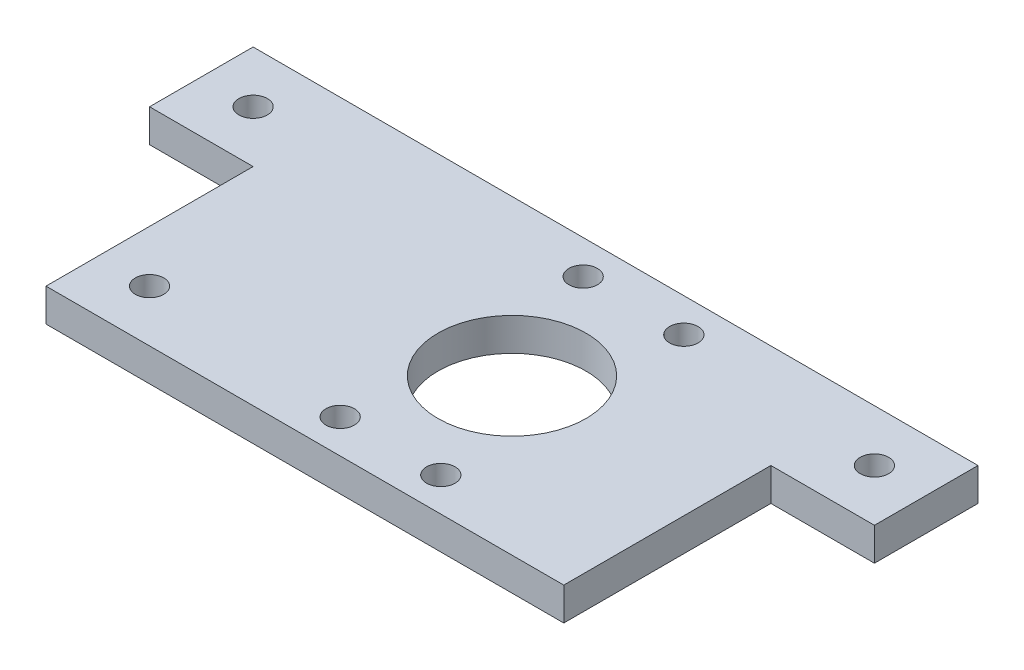
ISO-10303-21;
HEADER;
FILE_DESCRIPTION(('STEP AP214'),'2;1');
FILE_NAME('part.step','',(''),(''),'','','');
FILE_SCHEMA(('AUTOMOTIVE_DESIGN { 1 0 10303 214 1 1 1 1 }'));
ENDSEC;
DATA;
#1=APPLICATION_CONTEXT('core data for automotive mechanical design processes');
#2=APPLICATION_PROTOCOL_DEFINITION('international standard','automotive_design',2000,#1);
#3=PRODUCT_CONTEXT('',#1,'mechanical');
#4=PRODUCT('Part','Part','',(#3));
#5=PRODUCT_RELATED_PRODUCT_CATEGORY('part','',(#4));
#6=PRODUCT_DEFINITION_FORMATION('','',#4);
#7=PRODUCT_DEFINITION_CONTEXT('part definition',#1,'design');
#8=PRODUCT_DEFINITION('design','',#6,#7);
#9=PRODUCT_DEFINITION_SHAPE('','',#8);
#10=(LENGTH_UNIT() NAMED_UNIT(*) SI_UNIT(.MILLI.,.METRE.));
#11=(NAMED_UNIT(*) PLANE_ANGLE_UNIT() SI_UNIT($,.RADIAN.));
#12=(NAMED_UNIT(*) SI_UNIT($,.STERADIAN.) SOLID_ANGLE_UNIT());
#13=UNCERTAINTY_MEASURE_WITH_UNIT(LENGTH_MEASURE(1.E-05),#10,'distance_accuracy_value','');
#14=(GEOMETRIC_REPRESENTATION_CONTEXT(3) GLOBAL_UNCERTAINTY_ASSIGNED_CONTEXT((#13)) GLOBAL_UNIT_ASSIGNED_CONTEXT((#10,
#11,#12)) REPRESENTATION_CONTEXT('',''));
#15=CARTESIAN_POINT('',(0.,0.,0.));
#16=DIRECTION('',(0.,0.,1.));
#17=DIRECTION('',(1.,0.,0.));
#18=AXIS2_PLACEMENT_3D('',#15,#16,#17);
#19=CARTESIAN_POINT('',(-58.7953991363547,6.35,-3.76310779408653));
#20=DIRECTION('',(1.,0.,0.));
#21=DIRECTION('',(0.,0.,-1.));
#22=AXIS2_PLACEMENT_3D('',#19,#20,#21);
#23=PLANE('',#22);
#24=DIRECTION('',(0.,0.,1.));
#25=VECTOR('',#24,1.);
#26=CARTESIAN_POINT('',(-58.7953991363547,0.,-3.76310779408653));
#27=LINE('',#26,#25);
#28=CARTESIAN_POINT('',(-58.7953991363547,0.,-63.7631077940865));
#29=VERTEX_POINT('',#28);
#30=CARTESIAN_POINT('',(-58.7953991363547,0.,-43.7631077940865));
#31=VERTEX_POINT('',#30);
#32=EDGE_CURVE('E127',#29,#31,#27,.T.);
#33=ORIENTED_EDGE('',*,*,#32,.T.);
#34=DIRECTION('',(0.,1.,0.));
#35=VECTOR('',#34,1.);
#36=CARTESIAN_POINT('',(-58.7953991363547,-0.00100000000000013,-43.7631077940865));
#37=LINE('',#36,#35);
#38=CARTESIAN_POINT('',(-58.7953991363547,6.35,-43.7631077940865));
#39=VERTEX_POINT('',#38);
#40=EDGE_CURVE('E198',#31,#39,#37,.T.);
#41=ORIENTED_EDGE('',*,*,#40,.T.);
#42=DIRECTION('',(0.,0.,1.));
#43=VECTOR('',#42,1.);
#44=CARTESIAN_POINT('',(-58.7953991363547,6.35,-3.76310779408653));
#45=LINE('',#44,#43);
#46=CARTESIAN_POINT('',(-58.7953991363547,6.35,-63.7631077940865));
#47=VERTEX_POINT('',#46);
#48=EDGE_CURVE('E136',#47,#39,#45,.T.);
#49=ORIENTED_EDGE('',*,*,#48,.F.);
#50=DIRECTION('',(0.,-1.,0.));
#51=VECTOR('',#50,1.);
#52=CARTESIAN_POINT('',(-58.7953991363547,6.35,-63.7631077940865));
#53=LINE('',#52,#51);
#54=EDGE_CURVE('E46',#47,#29,#53,.T.);
#55=ORIENTED_EDGE('',*,*,#54,.T.);
#56=EDGE_LOOP('',(#33,#41,#49,#55));
#57=FACE_BOUND('',#56,.T.);
#58=ADVANCED_FACE('F39',(#57),#23,.F.);
#59=CARTESIAN_POINT('',(-58.7953991363547,6.35,-3.76310779408653));
#60=DIRECTION('',(0.,0.,-1.));
#61=DIRECTION('',(-1.,0.,0.));
#62=AXIS2_PLACEMENT_3D('',#59,#60,#61);
#63=PLANE('',#62);
#64=DIRECTION('',(1.,0.,0.));
#65=VECTOR('',#64,1.);
#66=CARTESIAN_POINT('',(-58.7953991363547,6.35,-3.76310779408653));
#67=LINE('',#66,#65);
#68=CARTESIAN_POINT('',(-38.7953991363547,6.35,-3.76310779408653));
#69=VERTEX_POINT('',#68);
#70=CARTESIAN_POINT('',(61.2046008636453,6.35,-3.76310779408653));
#71=VERTEX_POINT('',#70);
#72=EDGE_CURVE('E119',#69,#71,#67,.T.);
#73=ORIENTED_EDGE('',*,*,#72,.F.);
#74=DIRECTION('',(0.,1.,0.));
#75=VECTOR('',#74,1.);
#76=CARTESIAN_POINT('',(-38.7953991363547,-0.00100000000000013,-3.76310779408653));
#77=LINE('',#76,#75);
#78=CARTESIAN_POINT('',(-38.7953991363547,0.,-3.76310779408653));
#79=VERTEX_POINT('',#78);
#80=EDGE_CURVE('E104',#79,#69,#77,.T.);
#81=ORIENTED_EDGE('',*,*,#80,.F.);
#82=DIRECTION('',(1.,0.,0.));
#83=VECTOR('',#82,1.);
#84=CARTESIAN_POINT('',(-58.7953991363547,0.,-3.76310779408653));
#85=LINE('',#84,#83);
#86=CARTESIAN_POINT('',(61.2046008636453,0.,-3.76310779408653));
#87=VERTEX_POINT('',#86);
#88=EDGE_CURVE('E117',#79,#87,#85,.T.);
#89=ORIENTED_EDGE('',*,*,#88,.T.);
#90=DIRECTION('',(0.,1.,0.));
#91=VECTOR('',#90,1.);
#92=CARTESIAN_POINT('',(61.2046008636453,-0.00100000000000013,-3.76310779408653));
#93=LINE('',#92,#91);
#94=EDGE_CURVE('E182',#87,#71,#93,.T.);
#95=ORIENTED_EDGE('',*,*,#94,.T.);
#96=EDGE_LOOP('',(#73,#81,#89,#95));
#97=FACE_BOUND('',#96,.T.);
#98=ADVANCED_FACE('F115',(#97),#63,.F.);
#99=CARTESIAN_POINT('',(81.2046008636453,6.35,-3.76310779408653));
#100=DIRECTION('',(-1.,0.,0.));
#101=DIRECTION('',(0.,0.,1.));
#102=AXIS2_PLACEMENT_3D('',#99,#100,#101);
#103=PLANE('',#102);
#104=DIRECTION('',(0.,0.,-1.));
#105=VECTOR('',#104,1.);
#106=CARTESIAN_POINT('',(81.2046008636453,6.35,-3.76310779408653));
#107=LINE('',#106,#105);
#108=CARTESIAN_POINT('',(81.2046008636453,6.35,-43.7631077940865));
#109=VERTEX_POINT('',#108);
#110=CARTESIAN_POINT('',(81.2046008636453,6.35,-63.7631077940865));
#111=VERTEX_POINT('',#110);
#112=EDGE_CURVE('E143',#109,#111,#107,.T.);
#113=ORIENTED_EDGE('',*,*,#112,.F.);
#114=DIRECTION('',(0.,1.,0.));
#115=VECTOR('',#114,1.);
#116=CARTESIAN_POINT('',(81.2046008636453,-0.00100000000000013,-43.7631077940865));
#117=LINE('',#116,#115);
#118=CARTESIAN_POINT('',(81.2046008636453,0.,-43.7631077940865));
#119=VERTEX_POINT('',#118);
#120=EDGE_CURVE('E183',#119,#109,#117,.T.);
#121=ORIENTED_EDGE('',*,*,#120,.F.);
#122=DIRECTION('',(0.,0.,-1.));
#123=VECTOR('',#122,1.);
#124=CARTESIAN_POINT('',(81.2046008636453,0.,-3.76310779408653));
#125=LINE('',#124,#123);
#126=CARTESIAN_POINT('',(81.2046008636453,0.,-63.7631077940865));
#127=VERTEX_POINT('',#126);
#128=EDGE_CURVE('E126',#119,#127,#125,.T.);
#129=ORIENTED_EDGE('',*,*,#128,.T.);
#130=DIRECTION('',(0.,-1.,0.));
#131=VECTOR('',#130,1.);
#132=CARTESIAN_POINT('',(81.2046008636453,6.35,-63.7631077940865));
#133=LINE('',#132,#131);
#134=EDGE_CURVE('E11',#111,#127,#133,.T.);
#135=ORIENTED_EDGE('',*,*,#134,.F.);
#136=EDGE_LOOP('',(#113,#121,#129,#135));
#137=FACE_BOUND('',#136,.T.);
#138=ADVANCED_FACE('F255',(#137),#103,.F.);
#139=CARTESIAN_POINT('',(-58.7953991363547,6.35,-63.7631077940865));
#140=DIRECTION('',(0.,0.,1.));
#141=DIRECTION('',(1.,0.,0.));
#142=AXIS2_PLACEMENT_3D('',#139,#140,#141);
#143=PLANE('',#142);
#144=DIRECTION('',(-1.,0.,0.));
#145=VECTOR('',#144,1.);
#146=CARTESIAN_POINT('',(-58.7953991363547,0.,-63.7631077940865));
#147=LINE('',#146,#145);
#148=EDGE_CURVE('E129',#127,#29,#147,.T.);
#149=ORIENTED_EDGE('',*,*,#148,.T.);
#150=ORIENTED_EDGE('',*,*,#54,.F.);
#151=DIRECTION('',(-1.,0.,0.));
#152=VECTOR('',#151,1.);
#153=CARTESIAN_POINT('',(-58.7953991363547,6.35,-63.7631077940865));
#154=LINE('',#153,#152);
#155=EDGE_CURVE('E138',#111,#47,#154,.T.);
#156=ORIENTED_EDGE('',*,*,#155,.F.);
#157=ORIENTED_EDGE('',*,*,#134,.T.);
#158=EDGE_LOOP('',(#149,#150,#156,#157));
#159=FACE_BOUND('',#158,.T.);
#160=ADVANCED_FACE('F232',(#159),#143,.F.);
#161=CARTESIAN_POINT('',(0.,6.35,0.));
#162=DIRECTION('',(0.,-1.,0.));
#163=DIRECTION('',(0.,0.,-1.));
#164=AXIS2_PLACEMENT_3D('',#161,#162,#163);
#165=PLANE('',#164);
#166=CARTESIAN_POINT('',(71.2046008636453,6.35,-53.7631077940865));
#167=DIRECTION('',(0.,1.,0.));
#168=DIRECTION('',(0.,0.,1.));
#169=AXIS2_PLACEMENT_3D('',#166,#167,#168);
#170=CIRCLE('',#169,2.75000000000001);
#171=CARTESIAN_POINT('',(71.2046008636453,6.35,-51.0131077940865));
#172=VERTEX_POINT('',#171);
#173=EDGE_CURVE('E192',#172,#172,#170,.T.);
#174=ORIENTED_EDGE('',*,*,#173,.F.);
#175=EDGE_LOOP('',(#174));
#176=FACE_BOUND('',#175,.T.);
#177=CARTESIAN_POINT('',(-48.7953991363547,6.35,-53.7631077940865));
#178=DIRECTION('',(0.,1.,0.));
#179=DIRECTION('',(0.,0.,1.));
#180=AXIS2_PLACEMENT_3D('',#177,#178,#179);
#181=CIRCLE('',#180,2.75);
#182=CARTESIAN_POINT('',(-48.7953991363547,6.35,-51.0131077940865));
#183=VERTEX_POINT('',#182);
#184=EDGE_CURVE('E213',#183,#183,#181,.T.);
#185=ORIENTED_EDGE('',*,*,#184,.F.);
#186=EDGE_LOOP('',(#185));
#187=FACE_BOUND('',#186,.T.);
#188=CARTESIAN_POINT('',(-28.7953991363547,6.35,-13.7631077940865));
#189=DIRECTION('',(0.,1.,0.));
#190=DIRECTION('',(0.,0.,1.));
#191=AXIS2_PLACEMENT_3D('',#188,#189,#190);
#192=CIRCLE('',#191,2.75);
#193=CARTESIAN_POINT('',(-28.7953991363547,6.35,-11.0131077940865));
#194=VERTEX_POINT('',#193);
#195=EDGE_CURVE('E207',#194,#194,#192,.T.);
#196=ORIENTED_EDGE('',*,*,#195,.F.);
#197=EDGE_LOOP('',(#196));
#198=FACE_BOUND('',#197,.T.);
#199=CARTESIAN_POINT('',(30.9246008636453,6.35,-57.2297138546143));
#200=DIRECTION('',(0.,1.,0.));
#201=DIRECTION('',(0.,0.,1.));
#202=AXIS2_PLACEMENT_3D('',#199,#200,#201);
#203=CIRCLE('',#202,2.75);
#204=CARTESIAN_POINT('',(30.9246008636453,6.35,-54.4797138546143));
#205=VERTEX_POINT('',#204);
#206=EDGE_CURVE('E160',#205,#205,#203,.T.);
#207=ORIENTED_EDGE('',*,*,#206,.F.);
#208=EDGE_LOOP('',(#207));
#209=FACE_BOUND('',#208,.T.);
#210=CARTESIAN_POINT('',(11.4846008636453,6.35,-57.2297138546143));
#211=DIRECTION('',(0.,1.,0.));
#212=DIRECTION('',(0.,0.,1.));
#213=AXIS2_PLACEMENT_3D('',#210,#211,#212);
#214=CIRCLE('',#213,2.74999999999998);
#215=CARTESIAN_POINT('',(11.4846008636453,6.35,-54.4797138546143));
#216=VERTEX_POINT('',#215);
#217=EDGE_CURVE('E167',#216,#216,#214,.T.);
#218=ORIENTED_EDGE('',*,*,#217,.F.);
#219=EDGE_LOOP('',(#218));
#220=FACE_BOUND('',#219,.T.);
#221=CARTESIAN_POINT('',(11.4846008636453,6.35,-10.2965017335587));
#222=DIRECTION('',(0.,1.,0.));
#223=DIRECTION('',(0.,0.,1.));
#224=AXIS2_PLACEMENT_3D('',#221,#222,#223);
#225=CIRCLE('',#224,2.74999999999999);
#226=CARTESIAN_POINT('',(11.4846008636453,6.35,-7.54650173355873));
#227=VERTEX_POINT('',#226);
#228=EDGE_CURVE('E173',#227,#227,#225,.T.);
#229=ORIENTED_EDGE('',*,*,#228,.F.);
#230=EDGE_LOOP('',(#229));
#231=FACE_BOUND('',#230,.T.);
#232=CARTESIAN_POINT('',(30.9246008636453,6.35,-10.2965017335587));
#233=DIRECTION('',(0.,1.,0.));
#234=DIRECTION('',(0.,0.,1.));
#235=AXIS2_PLACEMENT_3D('',#232,#233,#234);
#236=CIRCLE('',#235,2.75);
#237=CARTESIAN_POINT('',(30.9246008636453,6.35,-7.54650173355872));
#238=VERTEX_POINT('',#237);
#239=EDGE_CURVE('E154',#238,#238,#236,.T.);
#240=ORIENTED_EDGE('',*,*,#239,.F.);
#241=EDGE_LOOP('',(#240));
#242=FACE_BOUND('',#241,.T.);
#243=CARTESIAN_POINT('',(21.2046008636453,6.35,-33.7631077940865));
#244=DIRECTION('',(0.,1.,0.));
#245=DIRECTION('',(0.,0.,1.));
#246=AXIS2_PLACEMENT_3D('',#243,#244,#245);
#247=CIRCLE('',#246,14.295);
#248=CARTESIAN_POINT('',(21.2046008636453,6.35,-19.4681077940865));
#249=VERTEX_POINT('',#248);
#250=EDGE_CURVE('E151',#249,#249,#247,.T.);
#251=ORIENTED_EDGE('',*,*,#250,.F.);
#252=EDGE_LOOP('',(#251));
#253=FACE_BOUND('',#252,.T.);
#254=ORIENTED_EDGE('',*,*,#48,.T.);
#255=DIRECTION('',(-1.,0.,0.));
#256=VECTOR('',#255,1.);
#257=CARTESIAN_POINT('',(-58.7953991363547,6.35,-43.7631077940865));
#258=LINE('',#257,#256);
#259=CARTESIAN_POINT('',(-38.7953991363547,6.35,-43.7631077940865));
#260=VERTEX_POINT('',#259);
#261=EDGE_CURVE('E120',#260,#39,#258,.T.);
#262=ORIENTED_EDGE('',*,*,#261,.F.);
#263=DIRECTION('',(0.,0.,-1.));
#264=VECTOR('',#263,1.);
#265=CARTESIAN_POINT('',(-38.7953991363547,6.35,-3.76310779408653));
#266=LINE('',#265,#264);
#267=EDGE_CURVE('E201',#69,#260,#266,.T.);
#268=ORIENTED_EDGE('',*,*,#267,.F.);
#269=ORIENTED_EDGE('',*,*,#72,.T.);
#270=DIRECTION('',(0.,0.,1.));
#271=VECTOR('',#270,1.);
#272=CARTESIAN_POINT('',(61.2046008636453,6.35,-3.76310779408653));
#273=LINE('',#272,#271);
#274=CARTESIAN_POINT('',(61.2046008636453,6.35,-43.7631077940865));
#275=VERTEX_POINT('',#274);
#276=EDGE_CURVE('E185',#275,#71,#273,.T.);
#277=ORIENTED_EDGE('',*,*,#276,.F.);
#278=DIRECTION('',(-1.,0.,0.));
#279=VECTOR('',#278,1.);
#280=CARTESIAN_POINT('',(81.2046008636453,6.35,-43.7631077940865));
#281=LINE('',#280,#279);
#282=EDGE_CURVE('E189',#109,#275,#281,.T.);
#283=ORIENTED_EDGE('',*,*,#282,.F.);
#284=ORIENTED_EDGE('',*,*,#112,.T.);
#285=ORIENTED_EDGE('',*,*,#155,.T.);
#286=EDGE_LOOP('',(#254,#262,#268,#269,#277,#283,#284,#285));
#287=FACE_BOUND('',#286,.T.);
#288=ADVANCED_FACE('F229',(#176,#187,#198,#209,#220,#231,#242,#253,#287),#165,.F.);
#289=CARTESIAN_POINT('',(0.,0.,0.));
#290=DIRECTION('',(0.,-1.,0.));
#291=DIRECTION('',(0.,0.,-1.));
#292=AXIS2_PLACEMENT_3D('',#289,#290,#291);
#293=PLANE('',#292);
#294=DIRECTION('',(-1.,0.,0.));
#295=VECTOR('',#294,1.);
#296=CARTESIAN_POINT('',(-58.7953991363547,0.,-43.7631077940865));
#297=LINE('',#296,#295);
#298=CARTESIAN_POINT('',(-38.7953991363547,0.,-43.7631077940865));
#299=VERTEX_POINT('',#298);
#300=EDGE_CURVE('E110',#299,#31,#297,.T.);
#301=ORIENTED_EDGE('',*,*,#300,.T.);
#302=ORIENTED_EDGE('',*,*,#32,.F.);
#303=ORIENTED_EDGE('',*,*,#148,.F.);
#304=ORIENTED_EDGE('',*,*,#128,.F.);
#305=DIRECTION('',(-1.,0.,0.));
#306=VECTOR('',#305,1.);
#307=CARTESIAN_POINT('',(81.2046008636453,0.,-43.7631077940865));
#308=LINE('',#307,#306);
#309=CARTESIAN_POINT('',(61.2046008636453,0.,-43.7631077940865));
#310=VERTEX_POINT('',#309);
#311=EDGE_CURVE('E161',#119,#310,#308,.T.);
#312=ORIENTED_EDGE('',*,*,#311,.T.);
#313=DIRECTION('',(0.,0.,1.));
#314=VECTOR('',#313,1.);
#315=CARTESIAN_POINT('',(61.2046008636453,0.,-3.76310779408653));
#316=LINE('',#315,#314);
#317=EDGE_CURVE('E109',#310,#87,#316,.T.);
#318=ORIENTED_EDGE('',*,*,#317,.T.);
#319=ORIENTED_EDGE('',*,*,#88,.F.);
#320=DIRECTION('',(0.,0.,-1.));
#321=VECTOR('',#320,1.);
#322=CARTESIAN_POINT('',(-38.7953991363547,0.,-3.76310779408653));
#323=LINE('',#322,#321);
#324=EDGE_CURVE('E101',#79,#299,#323,.T.);
#325=ORIENTED_EDGE('',*,*,#324,.T.);
#326=EDGE_LOOP('',(#301,#302,#303,#304,#312,#318,#319,#325));
#327=FACE_BOUND('',#326,.T.);
#328=CARTESIAN_POINT('',(71.2046008636453,0.,-53.7631077940865));
#329=DIRECTION('',(0.,-1.,0.));
#330=DIRECTION('',(0.,0.,-1.));
#331=AXIS2_PLACEMENT_3D('',#328,#329,#330);
#332=CIRCLE('',#331,2.75000000000001);
#333=CARTESIAN_POINT('',(71.2046008636453,0.,-56.5131077940865));
#334=VERTEX_POINT('',#333);
#335=EDGE_CURVE('E195',#334,#334,#332,.F.);
#336=ORIENTED_EDGE('',*,*,#335,.T.);
#337=EDGE_LOOP('',(#336));
#338=FACE_BOUND('',#337,.T.);
#339=CARTESIAN_POINT('',(-48.7953991363547,0.,-53.7631077940865));
#340=DIRECTION('',(0.,-1.,0.));
#341=DIRECTION('',(0.,0.,-1.));
#342=AXIS2_PLACEMENT_3D('',#339,#340,#341);
#343=CIRCLE('',#342,2.75);
#344=CARTESIAN_POINT('',(-48.7953991363547,0.,-56.5131077940865));
#345=VERTEX_POINT('',#344);
#346=EDGE_CURVE('E196',#345,#345,#343,.F.);
#347=ORIENTED_EDGE('',*,*,#346,.T.);
#348=EDGE_LOOP('',(#347));
#349=FACE_BOUND('',#348,.T.);
#350=CARTESIAN_POINT('',(-28.7953991363547,0.,-13.7631077940865));
#351=DIRECTION('',(0.,-1.,0.));
#352=DIRECTION('',(0.,0.,-1.));
#353=AXIS2_PLACEMENT_3D('',#350,#351,#352);
#354=CIRCLE('',#353,2.75);
#355=CARTESIAN_POINT('',(-28.7953991363547,0.,-16.5131077940865));
#356=VERTEX_POINT('',#355);
#357=EDGE_CURVE('E210',#356,#356,#354,.F.);
#358=ORIENTED_EDGE('',*,*,#357,.T.);
#359=EDGE_LOOP('',(#358));
#360=FACE_BOUND('',#359,.T.);
#361=CARTESIAN_POINT('',(30.9246008636453,0.,-57.2297138546143));
#362=DIRECTION('',(0.,1.,0.));
#363=DIRECTION('',(0.,0.,1.));
#364=AXIS2_PLACEMENT_3D('',#361,#362,#363);
#365=CIRCLE('',#364,2.75);
#366=CARTESIAN_POINT('',(30.9246008636453,0.,-54.4797138546143));
#367=VERTEX_POINT('',#366);
#368=EDGE_CURVE('E157',#367,#367,#365,.T.);
#369=ORIENTED_EDGE('',*,*,#368,.T.);
#370=EDGE_LOOP('',(#369));
#371=FACE_BOUND('',#370,.T.);
#372=CARTESIAN_POINT('',(11.4846008636453,0.,-57.2297138546143));
#373=DIRECTION('',(0.,1.,0.));
#374=DIRECTION('',(0.,0.,1.));
#375=AXIS2_PLACEMENT_3D('',#372,#373,#374);
#376=CIRCLE('',#375,2.74999999999998);
#377=CARTESIAN_POINT('',(11.4846008636453,0.,-54.4797138546143));
#378=VERTEX_POINT('',#377);
#379=EDGE_CURVE('E164',#378,#378,#376,.T.);
#380=ORIENTED_EDGE('',*,*,#379,.T.);
#381=EDGE_LOOP('',(#380));
#382=FACE_BOUND('',#381,.T.);
#383=CARTESIAN_POINT('',(11.4846008636453,0.,-10.2965017335587));
#384=DIRECTION('',(0.,1.,0.));
#385=DIRECTION('',(0.,0.,1.));
#386=AXIS2_PLACEMENT_3D('',#383,#384,#385);
#387=CIRCLE('',#386,2.74999999999999);
#388=CARTESIAN_POINT('',(11.4846008636453,0.,-7.54650173355873));
#389=VERTEX_POINT('',#388);
#390=EDGE_CURVE('E170',#389,#389,#387,.T.);
#391=ORIENTED_EDGE('',*,*,#390,.T.);
#392=EDGE_LOOP('',(#391));
#393=FACE_BOUND('',#392,.T.);
#394=CARTESIAN_POINT('',(30.9246008636453,0.,-10.2965017335587));
#395=DIRECTION('',(0.,1.,0.));
#396=DIRECTION('',(0.,0.,1.));
#397=AXIS2_PLACEMENT_3D('',#394,#395,#396);
#398=CIRCLE('',#397,2.75);
#399=CARTESIAN_POINT('',(30.9246008636453,0.,-7.54650173355872));
#400=VERTEX_POINT('',#399);
#401=EDGE_CURVE('E176',#400,#400,#398,.T.);
#402=ORIENTED_EDGE('',*,*,#401,.T.);
#403=EDGE_LOOP('',(#402));
#404=FACE_BOUND('',#403,.T.);
#405=CARTESIAN_POINT('',(21.2046008636453,0.,-33.7631077940865));
#406=DIRECTION('',(0.,1.,0.));
#407=DIRECTION('',(0.,0.,1.));
#408=AXIS2_PLACEMENT_3D('',#405,#406,#407);
#409=CIRCLE('',#408,14.295);
#410=CARTESIAN_POINT('',(21.2046008636453,0.,-19.4681077940865));
#411=VERTEX_POINT('',#410);
#412=EDGE_CURVE('E132',#411,#411,#409,.T.);
#413=ORIENTED_EDGE('',*,*,#412,.T.);
#414=EDGE_LOOP('',(#413));
#415=FACE_BOUND('',#414,.T.);
#416=ADVANCED_FACE('F123',(#327,#338,#349,#360,#371,#382,#393,#404,#415),#293,.T.);
#417=CARTESIAN_POINT('',(21.2046008636453,0.,-33.7631077940865));
#418=DIRECTION('',(0.,1.,0.));
#419=DIRECTION('',(0.,0.,1.));
#420=AXIS2_PLACEMENT_3D('',#417,#418,#419);
#421=CYLINDRICAL_SURFACE('',#420,14.295);
#422=ORIENTED_EDGE('',*,*,#412,.F.);
#423=EDGE_LOOP('',(#422));
#424=FACE_BOUND('',#423,.T.);
#425=ORIENTED_EDGE('',*,*,#250,.T.);
#426=EDGE_LOOP('',(#425));
#427=FACE_BOUND('',#426,.T.);
#428=ADVANCED_FACE('F286',(#424,#427),#421,.F.);
#429=CARTESIAN_POINT('',(30.9246008636453,0.,-10.2965017335587));
#430=DIRECTION('',(0.,1.,0.));
#431=DIRECTION('',(0.,0.,1.));
#432=AXIS2_PLACEMENT_3D('',#429,#430,#431);
#433=CYLINDRICAL_SURFACE('',#432,2.75);
#434=ORIENTED_EDGE('',*,*,#401,.F.);
#435=EDGE_LOOP('',(#434));
#436=FACE_BOUND('',#435,.T.);
#437=ORIENTED_EDGE('',*,*,#239,.T.);
#438=EDGE_LOOP('',(#437));
#439=FACE_BOUND('',#438,.T.);
#440=ADVANCED_FACE('F289',(#436,#439),#433,.F.);
#441=CARTESIAN_POINT('',(11.4846008636453,0.,-10.2965017335587));
#442=DIRECTION('',(0.,1.,0.));
#443=DIRECTION('',(0.,0.,1.));
#444=AXIS2_PLACEMENT_3D('',#441,#442,#443);
#445=CYLINDRICAL_SURFACE('',#444,2.74999999999999);
#446=ORIENTED_EDGE('',*,*,#390,.F.);
#447=EDGE_LOOP('',(#446));
#448=FACE_BOUND('',#447,.T.);
#449=ORIENTED_EDGE('',*,*,#228,.T.);
#450=EDGE_LOOP('',(#449));
#451=FACE_BOUND('',#450,.T.);
#452=ADVANCED_FACE('F294',(#448,#451),#445,.F.);
#453=CARTESIAN_POINT('',(11.4846008636453,0.,-57.2297138546143));
#454=DIRECTION('',(0.,1.,0.));
#455=DIRECTION('',(0.,0.,1.));
#456=AXIS2_PLACEMENT_3D('',#453,#454,#455);
#457=CYLINDRICAL_SURFACE('',#456,2.74999999999998);
#458=ORIENTED_EDGE('',*,*,#379,.F.);
#459=EDGE_LOOP('',(#458));
#460=FACE_BOUND('',#459,.T.);
#461=ORIENTED_EDGE('',*,*,#217,.T.);
#462=EDGE_LOOP('',(#461));
#463=FACE_BOUND('',#462,.T.);
#464=ADVANCED_FACE('F271',(#460,#463),#457,.F.);
#465=CARTESIAN_POINT('',(30.9246008636453,0.,-57.2297138546143));
#466=DIRECTION('',(0.,1.,0.));
#467=DIRECTION('',(0.,0.,1.));
#468=AXIS2_PLACEMENT_3D('',#465,#466,#467);
#469=CYLINDRICAL_SURFACE('',#468,2.75);
#470=ORIENTED_EDGE('',*,*,#368,.F.);
#471=EDGE_LOOP('',(#470));
#472=FACE_BOUND('',#471,.T.);
#473=ORIENTED_EDGE('',*,*,#206,.T.);
#474=EDGE_LOOP('',(#473));
#475=FACE_BOUND('',#474,.T.);
#476=ADVANCED_FACE('F263',(#472,#475),#469,.F.);
#477=CARTESIAN_POINT('',(61.2046008636453,-0.00100000000000013,-3.76310779408653));
#478=DIRECTION('',(-1.,0.,0.));
#479=DIRECTION('',(0.,0.,1.));
#480=AXIS2_PLACEMENT_3D('',#477,#478,#479);
#481=PLANE('',#480);
#482=DIRECTION('',(0.,1.,0.));
#483=VECTOR('',#482,1.);
#484=CARTESIAN_POINT('',(61.2046008636453,-0.00100000000000013,-43.7631077940865));
#485=LINE('',#484,#483);
#486=EDGE_CURVE('E61',#310,#275,#485,.T.);
#487=ORIENTED_EDGE('',*,*,#486,.T.);
#488=ORIENTED_EDGE('',*,*,#276,.T.);
#489=ORIENTED_EDGE('',*,*,#94,.F.);
#490=ORIENTED_EDGE('',*,*,#317,.F.);
#491=EDGE_LOOP('',(#487,#488,#489,#490));
#492=FACE_BOUND('',#491,.T.);
#493=ADVANCED_FACE('F261',(#492),#481,.F.);
#494=CARTESIAN_POINT('',(81.2046008636453,-0.00100000000000013,-43.7631077940865));
#495=DIRECTION('',(0.,0.,-1.));
#496=DIRECTION('',(-1.,0.,0.));
#497=AXIS2_PLACEMENT_3D('',#494,#495,#496);
#498=PLANE('',#497);
#499=ORIENTED_EDGE('',*,*,#120,.T.);
#500=ORIENTED_EDGE('',*,*,#282,.T.);
#501=ORIENTED_EDGE('',*,*,#486,.F.);
#502=ORIENTED_EDGE('',*,*,#311,.F.);
#503=EDGE_LOOP('',(#499,#500,#501,#502));
#504=FACE_BOUND('',#503,.T.);
#505=ADVANCED_FACE('F258',(#504),#498,.F.);
#506=CARTESIAN_POINT('',(-28.7953991363547,-0.00100000000000013,-13.7631077940865));
#507=DIRECTION('',(0.,1.,0.));
#508=DIRECTION('',(0.,0.,1.));
#509=AXIS2_PLACEMENT_3D('',#506,#507,#508);
#510=CYLINDRICAL_SURFACE('',#509,2.75);
#511=ORIENTED_EDGE('',*,*,#357,.F.);
#512=EDGE_LOOP('',(#511));
#513=FACE_BOUND('',#512,.T.);
#514=ORIENTED_EDGE('',*,*,#195,.T.);
#515=EDGE_LOOP('',(#514));
#516=FACE_BOUND('',#515,.T.);
#517=ADVANCED_FACE('F225',(#513,#516),#510,.F.);
#518=CARTESIAN_POINT('',(-48.7953991363547,-0.00100000000000013,-53.7631077940865));
#519=DIRECTION('',(0.,1.,0.));
#520=DIRECTION('',(0.,0.,1.));
#521=AXIS2_PLACEMENT_3D('',#518,#519,#520);
#522=CYLINDRICAL_SURFACE('',#521,2.75);
#523=ORIENTED_EDGE('',*,*,#346,.F.);
#524=EDGE_LOOP('',(#523));
#525=FACE_BOUND('',#524,.T.);
#526=ORIENTED_EDGE('',*,*,#184,.T.);
#527=EDGE_LOOP('',(#526));
#528=FACE_BOUND('',#527,.T.);
#529=ADVANCED_FACE('F221',(#525,#528),#522,.F.);
#530=CARTESIAN_POINT('',(71.2046008636453,-0.00100000000000013,-53.7631077940865));
#531=DIRECTION('',(0.,1.,0.));
#532=DIRECTION('',(0.,0.,1.));
#533=AXIS2_PLACEMENT_3D('',#530,#531,#532);
#534=CYLINDRICAL_SURFACE('',#533,2.75000000000001);
#535=ORIENTED_EDGE('',*,*,#335,.F.);
#536=EDGE_LOOP('',(#535));
#537=FACE_BOUND('',#536,.T.);
#538=ORIENTED_EDGE('',*,*,#173,.T.);
#539=EDGE_LOOP('',(#538));
#540=FACE_BOUND('',#539,.T.);
#541=ADVANCED_FACE('F224',(#537,#540),#534,.F.);
#542=CARTESIAN_POINT('',(-58.7953991363547,-0.00100000000000013,-43.7631077940865));
#543=DIRECTION('',(0.,0.,-1.));
#544=DIRECTION('',(-1.,0.,0.));
#545=AXIS2_PLACEMENT_3D('',#542,#543,#544);
#546=PLANE('',#545);
#547=DIRECTION('',(0.,1.,0.));
#548=VECTOR('',#547,1.);
#549=CARTESIAN_POINT('',(-38.7953991363547,-0.00100000000000013,-43.7631077940865));
#550=LINE('',#549,#548);
#551=EDGE_CURVE('E53',#299,#260,#550,.T.);
#552=ORIENTED_EDGE('',*,*,#551,.T.);
#553=ORIENTED_EDGE('',*,*,#261,.T.);
#554=ORIENTED_EDGE('',*,*,#40,.F.);
#555=ORIENTED_EDGE('',*,*,#300,.F.);
#556=EDGE_LOOP('',(#552,#553,#554,#555));
#557=FACE_BOUND('',#556,.T.);
#558=ADVANCED_FACE('F248',(#557),#546,.F.);
#559=CARTESIAN_POINT('',(-38.7953991363547,-0.00100000000000013,-3.76310779408653));
#560=DIRECTION('',(1.,0.,0.));
#561=DIRECTION('',(0.,0.,-1.));
#562=AXIS2_PLACEMENT_3D('',#559,#560,#561);
#563=PLANE('',#562);
#564=ORIENTED_EDGE('',*,*,#80,.T.);
#565=ORIENTED_EDGE('',*,*,#267,.T.);
#566=ORIENTED_EDGE('',*,*,#551,.F.);
#567=ORIENTED_EDGE('',*,*,#324,.F.);
#568=EDGE_LOOP('',(#564,#565,#566,#567));
#569=FACE_BOUND('',#568,.T.);
#570=ADVANCED_FACE('F103',(#569),#563,.F.);
#571=CLOSED_SHELL('',(#58,#98,#138,#160,#288,#416,#428,#440,#452,#464,#476,#493,#505,#517,#529,
#541,#558,#570));
#572=MANIFOLD_SOLID_BREP('B2',#571);
#573=ADVANCED_BREP_SHAPE_REPRESENTATION('',(#18,#572),#14);
#574=SHAPE_DEFINITION_REPRESENTATION(#9,#573);
ENDSEC;
END-ISO-10303-21;
